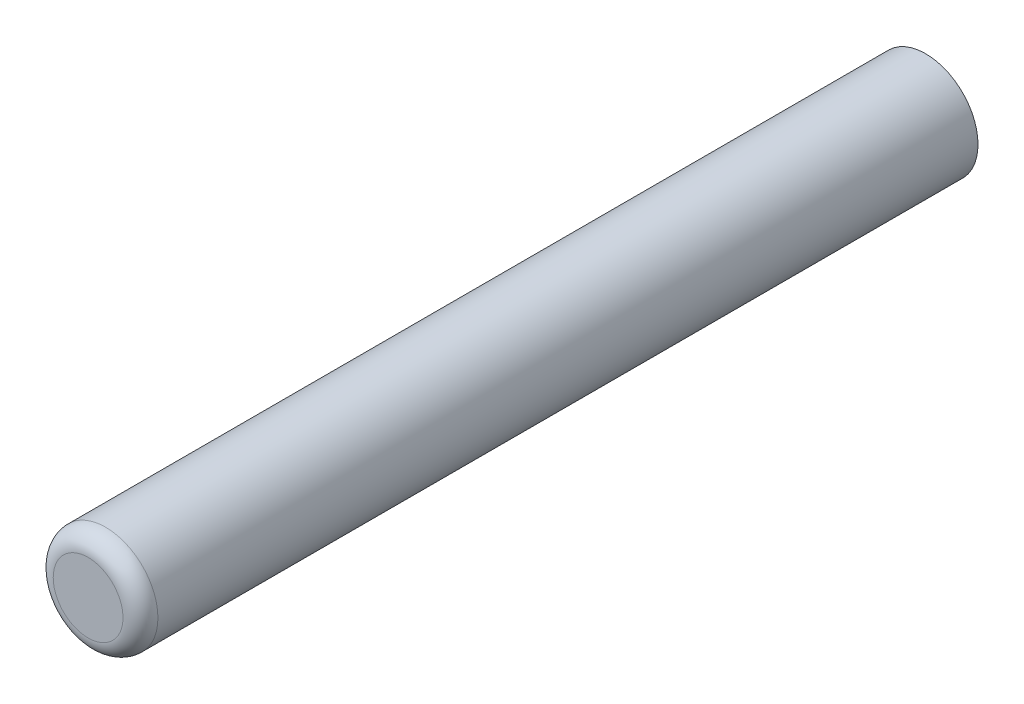
ISO-10303-21;
HEADER;
FILE_DESCRIPTION(('STEP AP214'),'2;1');
FILE_NAME('part.step','',(''),(''),'','','');
FILE_SCHEMA(('AUTOMOTIVE_DESIGN { 1 0 10303 214 1 1 1 1 }'));
ENDSEC;
DATA;
#1=APPLICATION_CONTEXT('core data for automotive mechanical design processes');
#2=APPLICATION_PROTOCOL_DEFINITION('international standard','automotive_design',2000,#1);
#3=PRODUCT_CONTEXT('',#1,'mechanical');
#4=PRODUCT('Part','Part','',(#3));
#5=PRODUCT_RELATED_PRODUCT_CATEGORY('part','',(#4));
#6=PRODUCT_DEFINITION_FORMATION('','',#4);
#7=PRODUCT_DEFINITION_CONTEXT('part definition',#1,'design');
#8=PRODUCT_DEFINITION('design','',#6,#7);
#9=PRODUCT_DEFINITION_SHAPE('','',#8);
#10=(LENGTH_UNIT() NAMED_UNIT(*) SI_UNIT(.MILLI.,.METRE.));
#11=(NAMED_UNIT(*) PLANE_ANGLE_UNIT() SI_UNIT($,.RADIAN.));
#12=(NAMED_UNIT(*) SI_UNIT($,.STERADIAN.) SOLID_ANGLE_UNIT());
#13=UNCERTAINTY_MEASURE_WITH_UNIT(LENGTH_MEASURE(1.E-05),#10,'distance_accuracy_value','');
#14=(GEOMETRIC_REPRESENTATION_CONTEXT(3) GLOBAL_UNCERTAINTY_ASSIGNED_CONTEXT((#13)) GLOBAL_UNIT_ASSIGNED_CONTEXT((#10,
#11,#12)) REPRESENTATION_CONTEXT('',''));
#15=CARTESIAN_POINT('',(0.,0.,0.));
#16=DIRECTION('',(0.,0.,1.));
#17=DIRECTION('',(1.,0.,0.));
#18=AXIS2_PLACEMENT_3D('',#15,#16,#17);
#19=CARTESIAN_POINT('',(0.,0.,0.));
#20=DIRECTION('',(0.,0.,-1.));
#21=DIRECTION('',(-1.,0.,0.));
#22=AXIS2_PLACEMENT_3D('',#19,#20,#21);
#23=PLANE('',#22);
#24=CARTESIAN_POINT('',(0.,0.,0.));
#25=DIRECTION('',(0.,0.,-1.));
#26=DIRECTION('',(-1.,0.,0.));
#27=AXIS2_PLACEMENT_3D('',#24,#25,#26);
#28=CIRCLE('',#27,3.175);
#29=CARTESIAN_POINT('',(-3.175,0.,0.));
#30=VERTEX_POINT('',#29);
#31=EDGE_CURVE('E57',#30,#30,#28,.F.);
#32=ORIENTED_EDGE('',*,*,#31,.T.);
#33=EDGE_LOOP('',(#32));
#34=FACE_BOUND('',#33,.T.);
#35=ADVANCED_FACE('F49',(#34),#23,.F.);
#36=CARTESIAN_POINT('',(0.,0.,0.));
#37=DIRECTION('',(0.,0.,1.));
#38=DIRECTION('',(1.,0.,0.));
#39=AXIS2_PLACEMENT_3D('',#36,#37,#38);
#40=CYLINDRICAL_SURFACE('',#39,4.7625);
#41=CARTESIAN_POINT('',(0.,0.,-1.5875));
#42=DIRECTION('',(0.,0.,-1.));
#43=DIRECTION('',(-1.,0.,0.));
#44=AXIS2_PLACEMENT_3D('',#41,#42,#43);
#45=CIRCLE('',#44,4.7625);
#46=CARTESIAN_POINT('',(-4.7625,0.,-1.5875));
#47=VERTEX_POINT('',#46);
#48=EDGE_CURVE('E10',#47,#47,#45,.T.);
#49=ORIENTED_EDGE('',*,*,#48,.T.);
#50=EDGE_LOOP('',(#49));
#51=FACE_BOUND('',#50,.T.);
#52=CARTESIAN_POINT('',(0.,0.,-76.2));
#53=DIRECTION('',(0.,0.,1.));
#54=DIRECTION('',(1.,0.,0.));
#55=AXIS2_PLACEMENT_3D('',#52,#53,#54);
#56=CIRCLE('',#55,4.7625);
#57=CARTESIAN_POINT('',(4.7625,0.,-76.2));
#58=VERTEX_POINT('',#57);
#59=EDGE_CURVE('E63',#58,#58,#56,.T.);
#60=ORIENTED_EDGE('',*,*,#59,.T.);
#61=EDGE_LOOP('',(#60));
#62=FACE_BOUND('',#61,.T.);
#63=ADVANCED_FACE('F70',(#51,#62),#40,.T.);
#64=CARTESIAN_POINT('',(0.,4.7625,-76.2));
#65=DIRECTION('',(0.,0.,1.));
#66=DIRECTION('',(1.,0.,0.));
#67=AXIS2_PLACEMENT_3D('',#64,#65,#66);
#68=PLANE('',#67);
#69=ORIENTED_EDGE('',*,*,#59,.F.);
#70=EDGE_LOOP('',(#69));
#71=FACE_BOUND('',#70,.T.);
#72=ADVANCED_FACE('F72',(#71),#68,.F.);
#73=CARTESIAN_POINT('',(0.,0.,-1.5875));
#74=DIRECTION('',(0.,0.,-1.));
#75=DIRECTION('',(-1.,0.,0.));
#76=AXIS2_PLACEMENT_3D('',#73,#74,#75);
#77=TOROIDAL_SURFACE('',#76,3.175,1.5875);
#78=ORIENTED_EDGE('',*,*,#48,.F.);
#79=EDGE_LOOP('',(#78));
#80=FACE_BOUND('',#79,.T.);
#81=ORIENTED_EDGE('',*,*,#31,.F.);
#82=EDGE_LOOP('',(#81));
#83=FACE_BOUND('',#82,.T.);
#84=ADVANCED_FACE('F51',(#80,#83),#77,.T.);
#85=CLOSED_SHELL('',(#35,#63,#72,#84));
#86=MANIFOLD_SOLID_BREP('B2',#85);
#87=ADVANCED_BREP_SHAPE_REPRESENTATION('',(#18,#86),#14);
#88=SHAPE_DEFINITION_REPRESENTATION(#9,#87);
ENDSEC;
END-ISO-10303-21;
